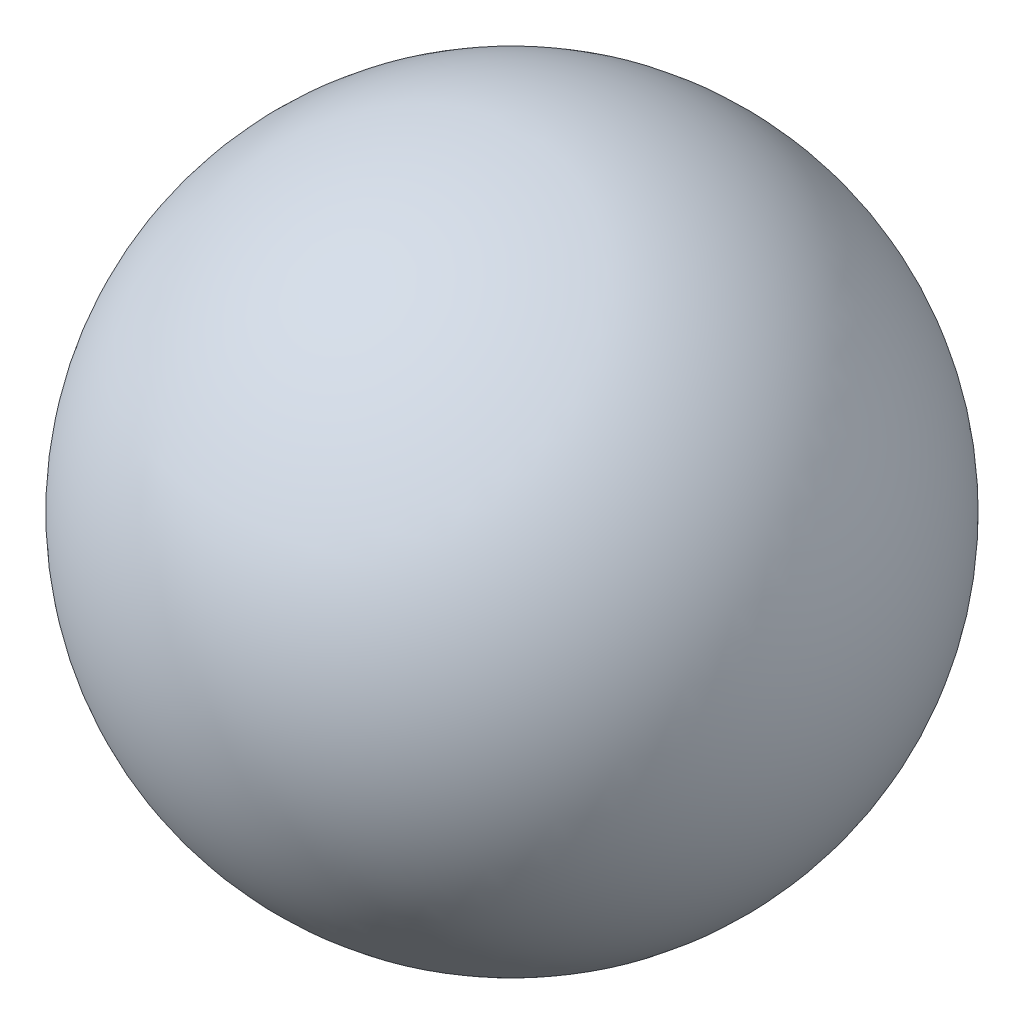
ISO-10303-21;
HEADER;
FILE_DESCRIPTION(('STEP AP214'),'2;1');
FILE_NAME('part.step','',(''),(''),'','','');
FILE_SCHEMA(('AUTOMOTIVE_DESIGN { 1 0 10303 214 1 1 1 1 }'));
ENDSEC;
DATA;
#1=APPLICATION_CONTEXT('core data for automotive mechanical design processes');
#2=APPLICATION_PROTOCOL_DEFINITION('international standard','automotive_design',2000,#1);
#3=PRODUCT_CONTEXT('',#1,'mechanical');
#4=PRODUCT('Part','Part','',(#3));
#5=PRODUCT_RELATED_PRODUCT_CATEGORY('part','',(#4));
#6=PRODUCT_DEFINITION_FORMATION('','',#4);
#7=PRODUCT_DEFINITION_CONTEXT('part definition',#1,'design');
#8=PRODUCT_DEFINITION('design','',#6,#7);
#9=PRODUCT_DEFINITION_SHAPE('','',#8);
#10=(LENGTH_UNIT() NAMED_UNIT(*) SI_UNIT(.MILLI.,.METRE.));
#11=(NAMED_UNIT(*) PLANE_ANGLE_UNIT() SI_UNIT($,.RADIAN.));
#12=(NAMED_UNIT(*) SI_UNIT($,.STERADIAN.) SOLID_ANGLE_UNIT());
#13=UNCERTAINTY_MEASURE_WITH_UNIT(LENGTH_MEASURE(1.E-05),#10,'distance_accuracy_value','');
#14=(GEOMETRIC_REPRESENTATION_CONTEXT(3) GLOBAL_UNCERTAINTY_ASSIGNED_CONTEXT((#13)) GLOBAL_UNIT_ASSIGNED_CONTEXT((#10,
#11,#12)) REPRESENTATION_CONTEXT('',''));
#15=CARTESIAN_POINT('',(0.,0.,0.));
#16=DIRECTION('',(0.,0.,1.));
#17=DIRECTION('',(1.,0.,0.));
#18=AXIS2_PLACEMENT_3D('',#15,#16,#17);
#19=CARTESIAN_POINT('',(0.,0.,0.));
#20=DIRECTION('',(0.,-1.,0.));
#21=DIRECTION('',(-1.,0.,0.));
#22=AXIS2_PLACEMENT_3D('',#19,#20,#21);
#23=SPHERICAL_SURFACE('',#22,19.05);
#24=CARTESIAN_POINT('',(0.,-19.05,0.));
#25=VERTEX_POINT('',#24);
#26=VERTEX_LOOP('',#25);
#27=FACE_BOUND('',#26,.T.);
#28=ADVANCED_FACE('F32',(#27),#23,.T.);
#29=CLOSED_SHELL('',(#28));
#30=CARTESIAN_POINT('',(0.,0.,0.));
#31=DIRECTION('',(0.,-1.,0.));
#32=DIRECTION('',(1.,0.,0.));
#33=AXIS2_PLACEMENT_3D('',#30,#31,#32);
#34=SPHERICAL_SURFACE('',#33,18.5674);
#35=CARTESIAN_POINT('',(0.,-18.5674,0.));
#36=VERTEX_POINT('',#35);
#37=VERTEX_LOOP('',#36);
#38=FACE_BOUND('',#37,.T.);
#39=ADVANCED_FACE('F45',(#38),#34,.F.);
#40=CLOSED_SHELL('',(#39));
#41=ORIENTED_CLOSED_SHELL('',*,#40,.T.);
#42=BREP_WITH_VOIDS('B2',#29,(#41));
#43=ADVANCED_BREP_SHAPE_REPRESENTATION('',(#18,#42),#14);
#44=SHAPE_DEFINITION_REPRESENTATION(#9,#43);
ENDSEC;
END-ISO-10303-21;
